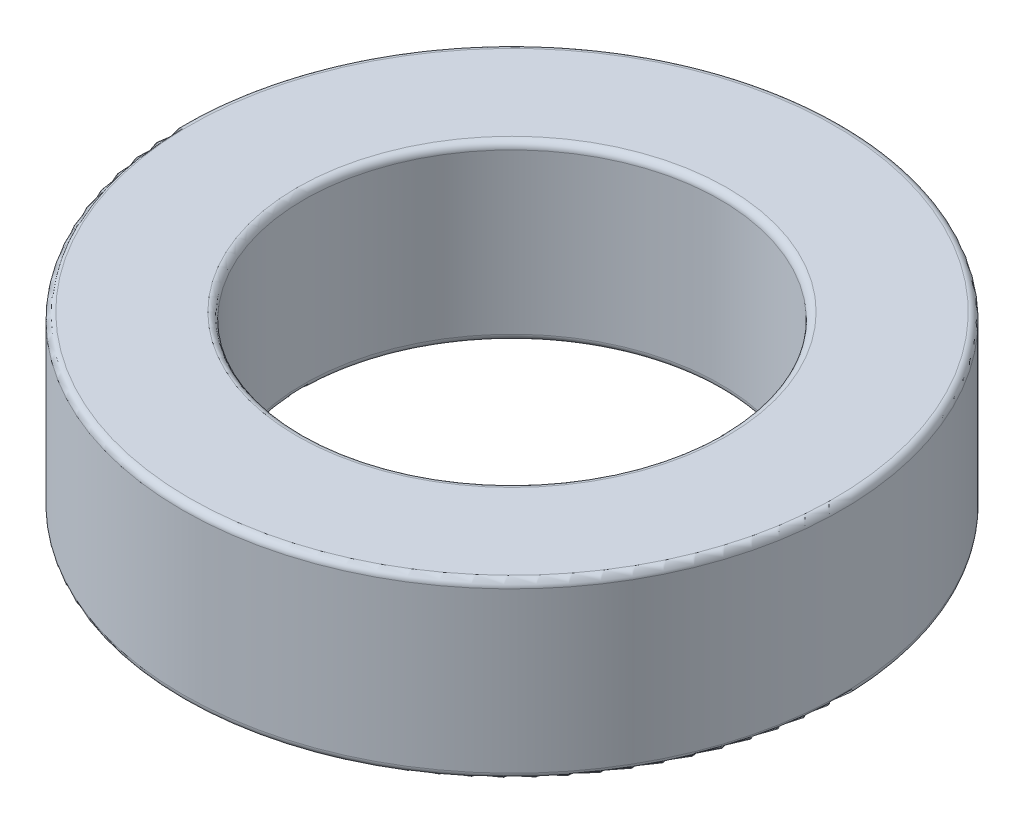
ISO-10303-21;
HEADER;
FILE_DESCRIPTION(('STEP AP214'),'2;1');
FILE_NAME('part.step','',(''),(''),'','','');
FILE_SCHEMA(('AUTOMOTIVE_DESIGN { 1 0 10303 214 1 1 1 1 }'));
ENDSEC;
DATA;
#1=APPLICATION_CONTEXT('core data for automotive mechanical design processes');
#2=APPLICATION_PROTOCOL_DEFINITION('international standard','automotive_design',2000,#1);
#3=PRODUCT_CONTEXT('',#1,'mechanical');
#4=PRODUCT('Part','Part','',(#3));
#5=PRODUCT_RELATED_PRODUCT_CATEGORY('part','',(#4));
#6=PRODUCT_DEFINITION_FORMATION('','',#4);
#7=PRODUCT_DEFINITION_CONTEXT('part definition',#1,'design');
#8=PRODUCT_DEFINITION('design','',#6,#7);
#9=PRODUCT_DEFINITION_SHAPE('','',#8);
#10=(LENGTH_UNIT() NAMED_UNIT(*) SI_UNIT(.MILLI.,.METRE.));
#11=(NAMED_UNIT(*) PLANE_ANGLE_UNIT() SI_UNIT($,.RADIAN.));
#12=(NAMED_UNIT(*) SI_UNIT($,.STERADIAN.) SOLID_ANGLE_UNIT());
#13=UNCERTAINTY_MEASURE_WITH_UNIT(LENGTH_MEASURE(1.E-05),#10,'distance_accuracy_value','');
#14=(GEOMETRIC_REPRESENTATION_CONTEXT(3) GLOBAL_UNCERTAINTY_ASSIGNED_CONTEXT((#13)) GLOBAL_UNIT_ASSIGNED_CONTEXT((#10,
#11,#12)) REPRESENTATION_CONTEXT('',''));
#15=CARTESIAN_POINT('',(0.,0.,0.));
#16=DIRECTION('',(0.,0.,1.));
#17=DIRECTION('',(1.,0.,0.));
#18=AXIS2_PLACEMENT_3D('',#15,#16,#17);
#19=CARTESIAN_POINT('',(0.,5.,0.));
#20=DIRECTION('',(0.,1.,0.));
#21=DIRECTION('',(0.,0.,1.));
#22=AXIS2_PLACEMENT_3D('',#19,#20,#21);
#23=PLANE('',#22);
#24=CARTESIAN_POINT('',(0.,5.,0.));
#25=DIRECTION('',(0.,1.,0.));
#26=DIRECTION('',(0.,0.,1.));
#27=AXIS2_PLACEMENT_3D('',#24,#25,#26);
#28=CIRCLE('',#27,6.2);
#29=CARTESIAN_POINT('',(0.,5.,6.2));
#30=VERTEX_POINT('',#29);
#31=EDGE_CURVE('E53',#30,#30,#28,.F.);
#32=ORIENTED_EDGE('',*,*,#31,.T.);
#33=EDGE_LOOP('',(#32));
#34=FACE_BOUND('',#33,.T.);
#35=CARTESIAN_POINT('',(0.,5.,0.));
#36=DIRECTION('',(0.,1.,0.));
#37=DIRECTION('',(0.,0.,1.));
#38=AXIS2_PLACEMENT_3D('',#35,#36,#37);
#39=CIRCLE('',#38,9.3);
#40=CARTESIAN_POINT('',(0.,5.,9.3));
#41=VERTEX_POINT('',#40);
#42=EDGE_CURVE('E58',#41,#41,#39,.T.);
#43=ORIENTED_EDGE('',*,*,#42,.T.);
#44=EDGE_LOOP('',(#43));
#45=FACE_BOUND('',#44,.T.);
#46=ADVANCED_FACE('F40',(#34,#45),#23,.T.);
#47=CARTESIAN_POINT('',(0.,0.,0.));
#48=DIRECTION('',(0.,1.,0.));
#49=DIRECTION('',(0.,0.,1.));
#50=AXIS2_PLACEMENT_3D('',#47,#48,#49);
#51=PLANE('',#50);
#52=CARTESIAN_POINT('',(0.,0.,0.));
#53=DIRECTION('',(0.,1.,0.));
#54=DIRECTION('',(0.,0.,1.));
#55=AXIS2_PLACEMENT_3D('',#52,#53,#54);
#56=CIRCLE('',#55,6.2);
#57=CARTESIAN_POINT('',(0.,0.,6.2));
#58=VERTEX_POINT('',#57);
#59=EDGE_CURVE('E72',#58,#58,#56,.T.);
#60=ORIENTED_EDGE('',*,*,#59,.T.);
#61=EDGE_LOOP('',(#60));
#62=FACE_BOUND('',#61,.T.);
#63=CARTESIAN_POINT('',(0.,0.,0.));
#64=DIRECTION('',(0.,1.,0.));
#65=DIRECTION('',(0.,0.,1.));
#66=AXIS2_PLACEMENT_3D('',#63,#64,#65);
#67=CIRCLE('',#66,9.3);
#68=CARTESIAN_POINT('',(0.,0.,9.3));
#69=VERTEX_POINT('',#68);
#70=EDGE_CURVE('E76',#69,#69,#67,.F.);
#71=ORIENTED_EDGE('',*,*,#70,.T.);
#72=EDGE_LOOP('',(#71));
#73=FACE_BOUND('',#72,.T.);
#74=ADVANCED_FACE('F81',(#62,#73),#51,.F.);
#75=CARTESIAN_POINT('',(0.,5.,0.));
#76=DIRECTION('',(0.,-1.,0.));
#77=DIRECTION('',(0.,0.,-1.));
#78=AXIS2_PLACEMENT_3D('',#75,#76,#77);
#79=CYLINDRICAL_SURFACE('',#78,9.5);
#80=CARTESIAN_POINT('',(0.,0.2,0.));
#81=DIRECTION('',(0.,1.,0.));
#82=DIRECTION('',(0.,0.,1.));
#83=AXIS2_PLACEMENT_3D('',#80,#81,#82);
#84=CIRCLE('',#83,9.5);
#85=CARTESIAN_POINT('',(0.,0.2,9.5));
#86=VERTEX_POINT('',#85);
#87=EDGE_CURVE('E10',#86,#86,#84,.T.);
#88=ORIENTED_EDGE('',*,*,#87,.T.);
#89=EDGE_LOOP('',(#88));
#90=FACE_BOUND('',#89,.T.);
#91=CARTESIAN_POINT('',(0.,4.8,0.));
#92=DIRECTION('',(0.,1.,0.));
#93=DIRECTION('',(0.,0.,1.));
#94=AXIS2_PLACEMENT_3D('',#91,#92,#93);
#95=CIRCLE('',#94,9.5);
#96=CARTESIAN_POINT('',(0.,4.8,9.5));
#97=VERTEX_POINT('',#96);
#98=EDGE_CURVE('E48',#97,#97,#95,.F.);
#99=ORIENTED_EDGE('',*,*,#98,.T.);
#100=EDGE_LOOP('',(#99));
#101=FACE_BOUND('',#100,.T.);
#102=ADVANCED_FACE('F101',(#90,#101),#79,.T.);
#103=CARTESIAN_POINT('',(0.,5.,0.));
#104=DIRECTION('',(0.,-1.,0.));
#105=DIRECTION('',(0.,0.,-1.));
#106=AXIS2_PLACEMENT_3D('',#103,#104,#105);
#107=CYLINDRICAL_SURFACE('',#106,6.);
#108=CARTESIAN_POINT('',(0.,0.2,0.));
#109=DIRECTION('',(0.,1.,0.));
#110=DIRECTION('',(0.,0.,1.));
#111=AXIS2_PLACEMENT_3D('',#108,#109,#110);
#112=CIRCLE('',#111,6.);
#113=CARTESIAN_POINT('',(0.,0.2,6.));
#114=VERTEX_POINT('',#113);
#115=EDGE_CURVE('E64',#114,#114,#112,.F.);
#116=ORIENTED_EDGE('',*,*,#115,.T.);
#117=EDGE_LOOP('',(#116));
#118=FACE_BOUND('',#117,.T.);
#119=CARTESIAN_POINT('',(0.,4.8,0.));
#120=DIRECTION('',(0.,1.,0.));
#121=DIRECTION('',(0.,0.,1.));
#122=AXIS2_PLACEMENT_3D('',#119,#120,#121);
#123=CIRCLE('',#122,6.);
#124=CARTESIAN_POINT('',(0.,4.8,6.));
#125=VERTEX_POINT('',#124);
#126=EDGE_CURVE('E68',#125,#125,#123,.T.);
#127=ORIENTED_EDGE('',*,*,#126,.T.);
#128=EDGE_LOOP('',(#127));
#129=FACE_BOUND('',#128,.T.);
#130=ADVANCED_FACE('F106',(#118,#129),#107,.F.);
#131=CARTESIAN_POINT('',(0.,0.2,0.));
#132=DIRECTION('',(0.,1.,0.));
#133=DIRECTION('',(0.,0.,1.));
#134=AXIS2_PLACEMENT_3D('',#131,#132,#133);
#135=TOROIDAL_SURFACE('',#134,6.2,0.2);
#136=ORIENTED_EDGE('',*,*,#115,.F.);
#137=EDGE_LOOP('',(#136));
#138=FACE_BOUND('',#137,.T.);
#139=ORIENTED_EDGE('',*,*,#59,.F.);
#140=EDGE_LOOP('',(#139));
#141=FACE_BOUND('',#140,.T.);
#142=ADVANCED_FACE('F92',(#138,#141),#135,.T.);
#143=CARTESIAN_POINT('',(0.,4.8,0.));
#144=DIRECTION('',(0.,1.,0.));
#145=DIRECTION('',(0.,0.,1.));
#146=AXIS2_PLACEMENT_3D('',#143,#144,#145);
#147=TOROIDAL_SURFACE('',#146,6.2,0.2);
#148=ORIENTED_EDGE('',*,*,#31,.F.);
#149=EDGE_LOOP('',(#148));
#150=FACE_BOUND('',#149,.T.);
#151=ORIENTED_EDGE('',*,*,#126,.F.);
#152=EDGE_LOOP('',(#151));
#153=FACE_BOUND('',#152,.T.);
#154=ADVANCED_FACE('F86',(#150,#153),#147,.T.);
#155=CARTESIAN_POINT('',(0.,0.2,0.));
#156=DIRECTION('',(0.,1.,0.));
#157=DIRECTION('',(0.,0.,1.));
#158=AXIS2_PLACEMENT_3D('',#155,#156,#157);
#159=TOROIDAL_SURFACE('',#158,9.3,0.2);
#160=ORIENTED_EDGE('',*,*,#70,.F.);
#161=EDGE_LOOP('',(#160));
#162=FACE_BOUND('',#161,.T.);
#163=ORIENTED_EDGE('',*,*,#87,.F.);
#164=EDGE_LOOP('',(#163));
#165=FACE_BOUND('',#164,.T.);
#166=ADVANCED_FACE('F83',(#162,#165),#159,.T.);
#167=CARTESIAN_POINT('',(0.,4.8,0.));
#168=DIRECTION('',(0.,1.,0.));
#169=DIRECTION('',(0.,0.,1.));
#170=AXIS2_PLACEMENT_3D('',#167,#168,#169);
#171=TOROIDAL_SURFACE('',#170,9.3,0.2);
#172=ORIENTED_EDGE('',*,*,#98,.F.);
#173=EDGE_LOOP('',(#172));
#174=FACE_BOUND('',#173,.T.);
#175=ORIENTED_EDGE('',*,*,#42,.F.);
#176=EDGE_LOOP('',(#175));
#177=FACE_BOUND('',#176,.T.);
#178=ADVANCED_FACE('F42',(#174,#177),#171,.T.);
#179=CLOSED_SHELL('',(#46,#74,#102,#130,#142,#154,#166,#178));
#180=MANIFOLD_SOLID_BREP('B2',#179);
#181=ADVANCED_BREP_SHAPE_REPRESENTATION('',(#18,#180),#14);
#182=SHAPE_DEFINITION_REPRESENTATION(#9,#181);
ENDSEC;
END-ISO-10303-21;
